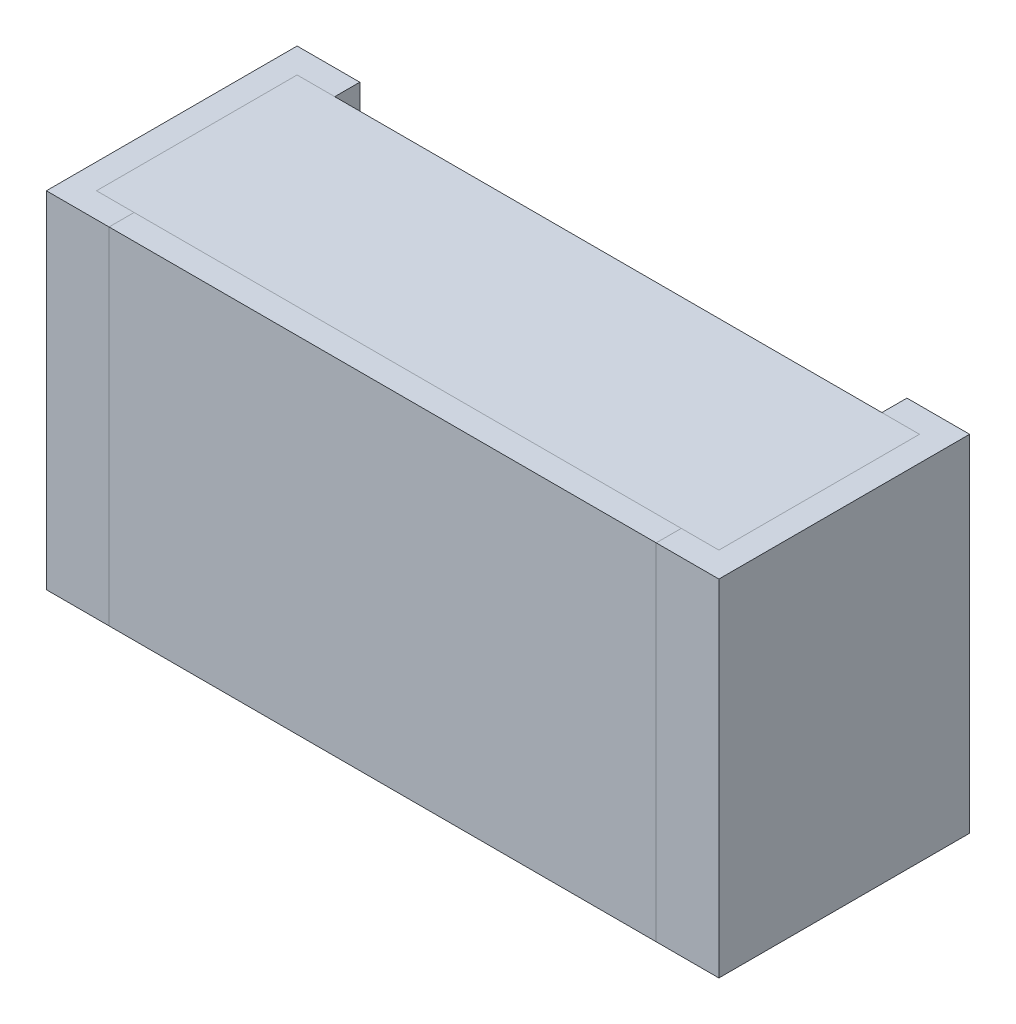
ISO-10303-21;
HEADER;
FILE_DESCRIPTION(('STEP AP214'),'2;1');
FILE_NAME('part.step','',(''),(''),'','','');
FILE_SCHEMA(('AUTOMOTIVE_DESIGN { 1 0 10303 214 1 1 1 1 }'));
ENDSEC;
DATA;
#1=APPLICATION_CONTEXT('core data for automotive mechanical design processes');
#2=APPLICATION_PROTOCOL_DEFINITION('international standard','automotive_design',2000,#1);
#3=PRODUCT_CONTEXT('',#1,'mechanical');
#4=PRODUCT('Part','Part','',(#3));
#5=PRODUCT_RELATED_PRODUCT_CATEGORY('part','',(#4));
#6=PRODUCT_DEFINITION_FORMATION('','',#4);
#7=PRODUCT_DEFINITION_CONTEXT('part definition',#1,'design');
#8=PRODUCT_DEFINITION('design','',#6,#7);
#9=PRODUCT_DEFINITION_SHAPE('','',#8);
#10=(LENGTH_UNIT() NAMED_UNIT(*) SI_UNIT(.MILLI.,.METRE.));
#11=(NAMED_UNIT(*) PLANE_ANGLE_UNIT() SI_UNIT($,.RADIAN.));
#12=(NAMED_UNIT(*) SI_UNIT($,.STERADIAN.) SOLID_ANGLE_UNIT());
#13=UNCERTAINTY_MEASURE_WITH_UNIT(LENGTH_MEASURE(1.E-05),#10,'distance_accuracy_value','');
#14=(GEOMETRIC_REPRESENTATION_CONTEXT(3) GLOBAL_UNCERTAINTY_ASSIGNED_CONTEXT((#13)) GLOBAL_UNIT_ASSIGNED_CONTEXT((#10,
#11,#12)) REPRESENTATION_CONTEXT('',''));
#15=CARTESIAN_POINT('',(0.,0.,0.));
#16=DIRECTION('',(0.,0.,1.));
#17=DIRECTION('',(1.,0.,0.));
#18=AXIS2_PLACEMENT_3D('',#15,#16,#17);
#19=CARTESIAN_POINT('',(-0.50436,-0.28,0.04064));
#20=DIRECTION('',(1.,0.,0.));
#21=DIRECTION('',(0.,0.,1.));
#22=AXIS2_PLACEMENT_3D('',#19,#20,#21);
#23=PLANE('',#22);
#24=DIRECTION('',(0.,1.,0.));
#25=VECTOR('',#24,1.);
#26=CARTESIAN_POINT('',(-0.50436,-0.28,0.36576));
#27=LINE('',#26,#25);
#28=CARTESIAN_POINT('',(-0.50436,-0.28,0.36576));
#29=VERTEX_POINT('',#28);
#30=CARTESIAN_POINT('',(-0.50436,0.28,0.36576));
#31=VERTEX_POINT('',#30);
#32=EDGE_CURVE('P0_E11',#29,#31,#27,.T.);
#33=ORIENTED_EDGE('',*,*,#32,.T.);
#34=DIRECTION('',(0.,0.,1.));
#35=VECTOR('',#34,1.);
#36=CARTESIAN_POINT('',(-0.50436,0.28,0.04064));
#37=LINE('',#36,#35);
#38=CARTESIAN_POINT('',(-0.50436,0.28,0.04064));
#39=VERTEX_POINT('',#38);
#40=EDGE_CURVE('P0_E24',#39,#31,#37,.T.);
#41=ORIENTED_EDGE('',*,*,#40,.F.);
#42=DIRECTION('',(0.,1.,0.));
#43=VECTOR('',#42,1.);
#44=CARTESIAN_POINT('',(-0.50436,-0.28,0.04064));
#45=LINE('',#44,#43);
#46=CARTESIAN_POINT('',(-0.50436,-0.28,0.04064));
#47=VERTEX_POINT('',#46);
#48=EDGE_CURVE('P0_E86',#47,#39,#45,.T.);
#49=ORIENTED_EDGE('',*,*,#48,.F.);
#50=DIRECTION('',(0.,0.,1.));
#51=VECTOR('',#50,1.);
#52=CARTESIAN_POINT('',(-0.50436,-0.28,0.04064));
#53=LINE('',#52,#51);
#54=EDGE_CURVE('P0_E36',#47,#29,#53,.T.);
#55=ORIENTED_EDGE('',*,*,#54,.T.);
#56=EDGE_LOOP('',(#33,#41,#49,#55));
#57=FACE_BOUND('',#56,.T.);
#58=ADVANCED_FACE('P0_F17',(#57),#23,.F.);
#59=CARTESIAN_POINT('',(0.50436,-0.28,0.04064));
#60=DIRECTION('',(1.,0.,0.));
#61=DIRECTION('',(0.,0.,1.));
#62=AXIS2_PLACEMENT_3D('',#59,#60,#61);
#63=PLANE('',#62);
#64=DIRECTION('',(0.,0.,1.));
#65=VECTOR('',#64,1.);
#66=CARTESIAN_POINT('',(0.50436,-0.28,0.04064));
#67=LINE('',#66,#65);
#68=CARTESIAN_POINT('',(0.50436,-0.28,0.04064));
#69=VERTEX_POINT('',#68);
#70=CARTESIAN_POINT('',(0.50436,-0.28,0.36576));
#71=VERTEX_POINT('',#70);
#72=EDGE_CURVE('P0_E83',#69,#71,#67,.T.);
#73=ORIENTED_EDGE('',*,*,#72,.F.);
#74=DIRECTION('',(0.,1.,0.));
#75=VECTOR('',#74,1.);
#76=CARTESIAN_POINT('',(0.50436,-0.28,0.04064));
#77=LINE('',#76,#75);
#78=CARTESIAN_POINT('',(0.50436,0.28,0.04064));
#79=VERTEX_POINT('',#78);
#80=EDGE_CURVE('P0_E63',#69,#79,#77,.T.);
#81=ORIENTED_EDGE('',*,*,#80,.T.);
#82=DIRECTION('',(0.,0.,1.));
#83=VECTOR('',#82,1.);
#84=CARTESIAN_POINT('',(0.50436,0.28,0.04064));
#85=LINE('',#84,#83);
#86=CARTESIAN_POINT('',(0.50436,0.28,0.36576));
#87=VERTEX_POINT('',#86);
#88=EDGE_CURVE('P0_E57',#79,#87,#85,.T.);
#89=ORIENTED_EDGE('',*,*,#88,.T.);
#90=DIRECTION('',(0.,1.,0.));
#91=VECTOR('',#90,1.);
#92=CARTESIAN_POINT('',(0.50436,-0.28,0.36576));
#93=LINE('',#92,#91);
#94=EDGE_CURVE('P0_E60',#71,#87,#93,.T.);
#95=ORIENTED_EDGE('',*,*,#94,.F.);
#96=EDGE_LOOP('',(#73,#81,#89,#95));
#97=FACE_BOUND('',#96,.T.);
#98=ADVANCED_FACE('P0_F59',(#97),#63,.T.);
#99=CARTESIAN_POINT('',(-0.50436,-0.28,0.04064));
#100=DIRECTION('',(0.,1.,0.));
#101=DIRECTION('',(0.,0.,1.));
#102=AXIS2_PLACEMENT_3D('',#99,#100,#101);
#103=PLANE('',#102);
#104=ORIENTED_EDGE('',*,*,#72,.T.);
#105=DIRECTION('',(1.,0.,0.));
#106=VECTOR('',#105,1.);
#107=CARTESIAN_POINT('',(-0.50436,-0.28,0.36576));
#108=LINE('',#107,#106);
#109=EDGE_CURVE('P0_E71',#29,#71,#108,.T.);
#110=ORIENTED_EDGE('',*,*,#109,.F.);
#111=ORIENTED_EDGE('',*,*,#54,.F.);
#112=DIRECTION('',(1.,0.,0.));
#113=VECTOR('',#112,1.);
#114=CARTESIAN_POINT('',(-0.50436,-0.28,0.04064));
#115=LINE('',#114,#113);
#116=EDGE_CURVE('P0_E76',#47,#69,#115,.T.);
#117=ORIENTED_EDGE('',*,*,#116,.T.);
#118=EDGE_LOOP('',(#104,#110,#111,#117));
#119=FACE_BOUND('',#118,.T.);
#120=ADVANCED_FACE('P0_F91',(#119),#103,.F.);
#121=CARTESIAN_POINT('',(-0.50436,0.28,0.04064));
#122=DIRECTION('',(0.,1.,0.));
#123=DIRECTION('',(0.,0.,1.));
#124=AXIS2_PLACEMENT_3D('',#121,#122,#123);
#125=PLANE('',#124);
#126=DIRECTION('',(1.,0.,0.));
#127=VECTOR('',#126,1.);
#128=CARTESIAN_POINT('',(-0.50436,0.28,0.04064));
#129=LINE('',#128,#127);
#130=EDGE_CURVE('P0_E74',#39,#79,#129,.T.);
#131=ORIENTED_EDGE('',*,*,#130,.F.);
#132=ORIENTED_EDGE('',*,*,#40,.T.);
#133=DIRECTION('',(1.,0.,0.));
#134=VECTOR('',#133,1.);
#135=CARTESIAN_POINT('',(-0.50436,0.28,0.36576));
#136=LINE('',#135,#134);
#137=EDGE_CURVE('P0_E69',#31,#87,#136,.T.);
#138=ORIENTED_EDGE('',*,*,#137,.T.);
#139=ORIENTED_EDGE('',*,*,#88,.F.);
#140=EDGE_LOOP('',(#131,#132,#138,#139));
#141=FACE_BOUND('',#140,.T.);
#142=ADVANCED_FACE('P0_F73',(#141),#125,.T.);
#143=CARTESIAN_POINT('',(-0.50436,-0.28,0.04064));
#144=DIRECTION('',(0.,0.,1.));
#145=DIRECTION('',(1.,0.,0.));
#146=AXIS2_PLACEMENT_3D('',#143,#144,#145);
#147=PLANE('',#146);
#148=ORIENTED_EDGE('',*,*,#130,.T.);
#149=ORIENTED_EDGE('',*,*,#80,.F.);
#150=ORIENTED_EDGE('',*,*,#116,.F.);
#151=ORIENTED_EDGE('',*,*,#48,.T.);
#152=EDGE_LOOP('',(#148,#149,#150,#151));
#153=FACE_BOUND('',#152,.T.);
#154=ADVANCED_FACE('P0_F89',(#153),#147,.F.);
#155=CARTESIAN_POINT('',(-0.50436,-0.28,0.36576));
#156=DIRECTION('',(0.,0.,1.));
#157=DIRECTION('',(1.,0.,0.));
#158=AXIS2_PLACEMENT_3D('',#155,#156,#157);
#159=PLANE('',#158);
#160=ORIENTED_EDGE('',*,*,#32,.F.);
#161=ORIENTED_EDGE('',*,*,#109,.T.);
#162=ORIENTED_EDGE('',*,*,#94,.T.);
#163=ORIENTED_EDGE('',*,*,#137,.F.);
#164=EDGE_LOOP('',(#160,#161,#162,#163));
#165=FACE_BOUND('',#164,.T.);
#166=ADVANCED_FACE('P0_F68',(#165),#159,.T.);
#167=CLOSED_SHELL('',(#58,#98,#120,#142,#154,#166));
#168=MANIFOLD_SOLID_BREP('P0_B1',#167);
#169=CARTESIAN_POINT('',(-0.545,-0.28,0.));
#170=DIRECTION('',(1.,0.,0.));
#171=DIRECTION('',(0.,0.,1.));
#172=AXIS2_PLACEMENT_3D('',#169,#170,#171);
#173=PLANE('',#172);
#174=DIRECTION('',(0.,1.,0.));
#175=VECTOR('',#174,1.);
#176=CARTESIAN_POINT('',(-0.545,-0.28,0.4064));
#177=LINE('',#176,#175);
#178=CARTESIAN_POINT('',(-0.545,-0.28,0.4064));
#179=VERTEX_POINT('',#178);
#180=CARTESIAN_POINT('',(-0.545,0.28,0.4064));
#181=VERTEX_POINT('',#180);
#182=EDGE_CURVE('P1_E11',#179,#181,#177,.T.);
#183=ORIENTED_EDGE('',*,*,#182,.T.);
#184=DIRECTION('',(0.,0.,1.));
#185=VECTOR('',#184,1.);
#186=CARTESIAN_POINT('',(-0.545,0.28,0.));
#187=LINE('',#186,#185);
#188=CARTESIAN_POINT('',(-0.545,0.28,0.));
#189=VERTEX_POINT('',#188);
#190=EDGE_CURVE('P1_E24',#189,#181,#187,.T.);
#191=ORIENTED_EDGE('',*,*,#190,.F.);
#192=DIRECTION('',(0.,1.,0.));
#193=VECTOR('',#192,1.);
#194=CARTESIAN_POINT('',(-0.545,-0.28,0.));
#195=LINE('',#194,#193);
#196=CARTESIAN_POINT('',(-0.545,-0.28,0.));
#197=VERTEX_POINT('',#196);
#198=EDGE_CURVE('P1_E139',#197,#189,#195,.T.);
#199=ORIENTED_EDGE('',*,*,#198,.F.);
#200=DIRECTION('',(0.,0.,1.));
#201=VECTOR('',#200,1.);
#202=CARTESIAN_POINT('',(-0.545,-0.28,0.));
#203=LINE('',#202,#201);
#204=EDGE_CURVE('P1_E36',#197,#179,#203,.T.);
#205=ORIENTED_EDGE('',*,*,#204,.T.);
#206=EDGE_LOOP('',(#183,#191,#199,#205));
#207=FACE_BOUND('',#206,.T.);
#208=ADVANCED_FACE('P1_F17',(#207),#173,.F.);
#209=CARTESIAN_POINT('',(-0.545,-0.28,0.));
#210=DIRECTION('',(0.,1.,0.));
#211=DIRECTION('',(0.,0.,1.));
#212=AXIS2_PLACEMENT_3D('',#209,#210,#211);
#213=PLANE('',#212);
#214=DIRECTION('',(1.,0.,0.));
#215=VECTOR('',#214,1.);
#216=CARTESIAN_POINT('',(-0.50436,-0.28,0.04064));
#217=LINE('',#216,#215);
#218=CARTESIAN_POINT('',(-0.50436,-0.28,0.04064));
#219=VERTEX_POINT('',#218);
#220=CARTESIAN_POINT('',(-0.4434,-0.28,0.04064));
#221=VERTEX_POINT('',#220);
#222=EDGE_CURVE('P1_E136',#219,#221,#217,.T.);
#223=ORIENTED_EDGE('',*,*,#222,.F.);
#224=DIRECTION('',(0.,0.,1.));
#225=VECTOR('',#224,1.);
#226=CARTESIAN_POINT('',(-0.50436,-0.28,0.04064));
#227=LINE('',#226,#225);
#228=CARTESIAN_POINT('',(-0.50436,-0.28,0.36576));
#229=VERTEX_POINT('',#228);
#230=EDGE_CURVE('P1_E99',#219,#229,#227,.T.);
#231=ORIENTED_EDGE('',*,*,#230,.T.);
#232=DIRECTION('',(1.,0.,0.));
#233=VECTOR('',#232,1.);
#234=CARTESIAN_POINT('',(-0.50436,-0.28,0.36576));
#235=LINE('',#234,#233);
#236=CARTESIAN_POINT('',(-0.4434,-0.28,0.36576));
#237=VERTEX_POINT('',#236);
#238=EDGE_CURVE('P1_E132',#229,#237,#235,.T.);
#239=ORIENTED_EDGE('',*,*,#238,.T.);
#240=DIRECTION('',(0.,0.,1.));
#241=VECTOR('',#240,1.);
#242=CARTESIAN_POINT('',(-0.4434,-0.28,0.));
#243=LINE('',#242,#241);
#244=CARTESIAN_POINT('',(-0.4434,-0.28,0.4064));
#245=VERTEX_POINT('',#244);
#246=EDGE_CURVE('P1_E129',#237,#245,#243,.T.);
#247=ORIENTED_EDGE('',*,*,#246,.T.);
#248=DIRECTION('',(1.,0.,0.));
#249=VECTOR('',#248,1.);
#250=CARTESIAN_POINT('',(-0.545,-0.28,0.4064));
#251=LINE('',#250,#249);
#252=EDGE_CURVE('P1_E127',#179,#245,#251,.T.);
#253=ORIENTED_EDGE('',*,*,#252,.F.);
#254=ORIENTED_EDGE('',*,*,#204,.F.);
#255=DIRECTION('',(1.,0.,0.));
#256=VECTOR('',#255,1.);
#257=CARTESIAN_POINT('',(-0.545,-0.28,0.));
#258=LINE('',#257,#256);
#259=CARTESIAN_POINT('',(-0.4434,-0.28,0.));
#260=VERTEX_POINT('',#259);
#261=EDGE_CURVE('P1_E124',#197,#260,#258,.T.);
#262=ORIENTED_EDGE('',*,*,#261,.T.);
#263=DIRECTION('',(0.,0.,1.));
#264=VECTOR('',#263,1.);
#265=CARTESIAN_POINT('',(-0.4434,-0.28,0.));
#266=LINE('',#265,#264);
#267=EDGE_CURVE('P1_E122',#260,#221,#266,.T.);
#268=ORIENTED_EDGE('',*,*,#267,.T.);
#269=EDGE_LOOP('',(#223,#231,#239,#247,#253,#254,#262,#268));
#270=FACE_BOUND('',#269,.T.);
#271=ADVANCED_FACE('P1_F161',(#270),#213,.F.);
#272=CARTESIAN_POINT('',(-0.545,-0.28,0.4064));
#273=DIRECTION('',(0.,0.,1.));
#274=DIRECTION('',(1.,0.,0.));
#275=AXIS2_PLACEMENT_3D('',#272,#273,#274);
#276=PLANE('',#275);
#277=ORIENTED_EDGE('',*,*,#182,.F.);
#278=ORIENTED_EDGE('',*,*,#252,.T.);
#279=DIRECTION('',(0.,1.,0.));
#280=VECTOR('',#279,1.);
#281=CARTESIAN_POINT('',(-0.4434,-0.28,0.4064));
#282=LINE('',#281,#280);
#283=CARTESIAN_POINT('',(-0.4434,0.28,0.4064));
#284=VERTEX_POINT('',#283);
#285=EDGE_CURVE('P1_E120',#245,#284,#282,.T.);
#286=ORIENTED_EDGE('',*,*,#285,.T.);
#287=DIRECTION('',(1.,0.,0.));
#288=VECTOR('',#287,1.);
#289=CARTESIAN_POINT('',(-0.545,0.28,0.4064));
#290=LINE('',#289,#288);
#291=EDGE_CURVE('P1_E118',#181,#284,#290,.T.);
#292=ORIENTED_EDGE('',*,*,#291,.F.);
#293=EDGE_LOOP('',(#277,#278,#286,#292));
#294=FACE_BOUND('',#293,.T.);
#295=ADVANCED_FACE('P1_F163',(#294),#276,.T.);
#296=CARTESIAN_POINT('',(-0.545,0.28,0.));
#297=DIRECTION('',(0.,1.,0.));
#298=DIRECTION('',(0.,0.,1.));
#299=AXIS2_PLACEMENT_3D('',#296,#297,#298);
#300=PLANE('',#299);
#301=DIRECTION('',(0.,0.,1.));
#302=VECTOR('',#301,1.);
#303=CARTESIAN_POINT('',(-0.4434,0.28,0.));
#304=LINE('',#303,#302);
#305=CARTESIAN_POINT('',(-0.4434,0.28,0.));
#306=VERTEX_POINT('',#305);
#307=CARTESIAN_POINT('',(-0.4434,0.28,0.04064));
#308=VERTEX_POINT('',#307);
#309=EDGE_CURVE('P1_E116',#306,#308,#304,.T.);
#310=ORIENTED_EDGE('',*,*,#309,.F.);
#311=DIRECTION('',(1.,0.,0.));
#312=VECTOR('',#311,1.);
#313=CARTESIAN_POINT('',(-0.545,0.28,0.));
#314=LINE('',#313,#312);
#315=EDGE_CURVE('P1_E113',#189,#306,#314,.T.);
#316=ORIENTED_EDGE('',*,*,#315,.F.);
#317=ORIENTED_EDGE('',*,*,#190,.T.);
#318=ORIENTED_EDGE('',*,*,#291,.T.);
#319=DIRECTION('',(0.,0.,1.));
#320=VECTOR('',#319,1.);
#321=CARTESIAN_POINT('',(-0.4434,0.28,0.));
#322=LINE('',#321,#320);
#323=CARTESIAN_POINT('',(-0.4434,0.28,0.36576));
#324=VERTEX_POINT('',#323);
#325=EDGE_CURVE('P1_E107',#324,#284,#322,.T.);
#326=ORIENTED_EDGE('',*,*,#325,.F.);
#327=DIRECTION('',(1.,0.,0.));
#328=VECTOR('',#327,1.);
#329=CARTESIAN_POINT('',(-0.50436,0.28,0.36576));
#330=LINE('',#329,#328);
#331=CARTESIAN_POINT('',(-0.50436,0.28,0.36576));
#332=VERTEX_POINT('',#331);
#333=EDGE_CURVE('P1_E105',#332,#324,#330,.T.);
#334=ORIENTED_EDGE('',*,*,#333,.F.);
#335=DIRECTION('',(0.,0.,1.));
#336=VECTOR('',#335,1.);
#337=CARTESIAN_POINT('',(-0.50436,0.28,0.04064));
#338=LINE('',#337,#336);
#339=CARTESIAN_POINT('',(-0.50436,0.28,0.04064));
#340=VERTEX_POINT('',#339);
#341=EDGE_CURVE('P1_E90',#340,#332,#338,.T.);
#342=ORIENTED_EDGE('',*,*,#341,.F.);
#343=DIRECTION('',(1.,0.,0.));
#344=VECTOR('',#343,1.);
#345=CARTESIAN_POINT('',(-0.50436,0.28,0.04064));
#346=LINE('',#345,#344);
#347=EDGE_CURVE('P1_E82',#340,#308,#346,.T.);
#348=ORIENTED_EDGE('',*,*,#347,.T.);
#349=EDGE_LOOP('',(#310,#316,#317,#318,#326,#334,#342,#348));
#350=FACE_BOUND('',#349,.T.);
#351=ADVANCED_FACE('P1_F103',(#350),#300,.T.);
#352=CARTESIAN_POINT('',(-0.545,-0.28,0.));
#353=DIRECTION('',(0.,0.,1.));
#354=DIRECTION('',(1.,0.,0.));
#355=AXIS2_PLACEMENT_3D('',#352,#353,#354);
#356=PLANE('',#355);
#357=ORIENTED_EDGE('',*,*,#315,.T.);
#358=DIRECTION('',(0.,1.,0.));
#359=VECTOR('',#358,1.);
#360=CARTESIAN_POINT('',(-0.4434,-0.28,0.));
#361=LINE('',#360,#359);
#362=EDGE_CURVE('P1_E91',#260,#306,#361,.T.);
#363=ORIENTED_EDGE('',*,*,#362,.F.);
#364=ORIENTED_EDGE('',*,*,#261,.F.);
#365=ORIENTED_EDGE('',*,*,#198,.T.);
#366=EDGE_LOOP('',(#357,#363,#364,#365));
#367=FACE_BOUND('',#366,.T.);
#368=ADVANCED_FACE('P1_F142',(#367),#356,.F.);
#369=CARTESIAN_POINT('',(-0.4434,-0.28,0.));
#370=DIRECTION('',(1.,0.,0.));
#371=DIRECTION('',(0.,0.,1.));
#372=AXIS2_PLACEMENT_3D('',#369,#370,#371);
#373=PLANE('',#372);
#374=ORIENTED_EDGE('',*,*,#267,.F.);
#375=ORIENTED_EDGE('',*,*,#362,.T.);
#376=ORIENTED_EDGE('',*,*,#309,.T.);
#377=DIRECTION('',(0.,-1.,0.));
#378=VECTOR('',#377,1.);
#379=CARTESIAN_POINT('',(-0.4434,-0.28,0.04064));
#380=LINE('',#379,#378);
#381=EDGE_CURVE('P1_E88',#308,#221,#380,.T.);
#382=ORIENTED_EDGE('',*,*,#381,.T.);
#383=EDGE_LOOP('',(#374,#375,#376,#382));
#384=FACE_BOUND('',#383,.T.);
#385=ADVANCED_FACE('P1_F147',(#384),#373,.T.);
#386=CARTESIAN_POINT('',(-0.50436,-0.28,0.04064));
#387=DIRECTION('',(0.,0.,1.));
#388=DIRECTION('',(1.,0.,0.));
#389=AXIS2_PLACEMENT_3D('',#386,#387,#388);
#390=PLANE('',#389);
#391=ORIENTED_EDGE('',*,*,#347,.F.);
#392=DIRECTION('',(0.,1.,0.));
#393=VECTOR('',#392,1.);
#394=CARTESIAN_POINT('',(-0.50436,-0.28,0.04064));
#395=LINE('',#394,#393);
#396=EDGE_CURVE('P1_E86',#219,#340,#395,.T.);
#397=ORIENTED_EDGE('',*,*,#396,.F.);
#398=ORIENTED_EDGE('',*,*,#222,.T.);
#399=ORIENTED_EDGE('',*,*,#381,.F.);
#400=EDGE_LOOP('',(#391,#397,#398,#399));
#401=FACE_BOUND('',#400,.T.);
#402=ADVANCED_FACE('P1_F84',(#401),#390,.T.);
#403=CARTESIAN_POINT('',(-0.50436,-0.28,0.04064));
#404=DIRECTION('',(1.,0.,0.));
#405=DIRECTION('',(0.,0.,1.));
#406=AXIS2_PLACEMENT_3D('',#403,#404,#405);
#407=PLANE('',#406);
#408=ORIENTED_EDGE('',*,*,#230,.F.);
#409=ORIENTED_EDGE('',*,*,#396,.T.);
#410=ORIENTED_EDGE('',*,*,#341,.T.);
#411=DIRECTION('',(0.,1.,0.));
#412=VECTOR('',#411,1.);
#413=CARTESIAN_POINT('',(-0.50436,-0.28,0.36576));
#414=LINE('',#413,#412);
#415=EDGE_CURVE('P1_E101',#229,#332,#414,.T.);
#416=ORIENTED_EDGE('',*,*,#415,.F.);
#417=EDGE_LOOP('',(#408,#409,#410,#416));
#418=FACE_BOUND('',#417,.T.);
#419=ADVANCED_FACE('P1_F95',(#418),#407,.T.);
#420=CARTESIAN_POINT('',(-0.50436,-0.28,0.36576));
#421=DIRECTION('',(0.,0.,1.));
#422=DIRECTION('',(1.,0.,0.));
#423=AXIS2_PLACEMENT_3D('',#420,#421,#422);
#424=PLANE('',#423);
#425=DIRECTION('',(0.,-1.,0.));
#426=VECTOR('',#425,1.);
#427=CARTESIAN_POINT('',(-0.4434,-0.28,0.36576));
#428=LINE('',#427,#426);
#429=EDGE_CURVE('P1_E151',#324,#237,#428,.T.);
#430=ORIENTED_EDGE('',*,*,#429,.T.);
#431=ORIENTED_EDGE('',*,*,#238,.F.);
#432=ORIENTED_EDGE('',*,*,#415,.T.);
#433=ORIENTED_EDGE('',*,*,#333,.T.);
#434=EDGE_LOOP('',(#430,#431,#432,#433));
#435=FACE_BOUND('',#434,.T.);
#436=ADVANCED_FACE('P1_F155',(#435),#424,.F.);
#437=CARTESIAN_POINT('',(-0.4434,-0.28,0.));
#438=DIRECTION('',(1.,0.,0.));
#439=DIRECTION('',(0.,0.,1.));
#440=AXIS2_PLACEMENT_3D('',#437,#438,#439);
#441=PLANE('',#440);
#442=ORIENTED_EDGE('',*,*,#246,.F.);
#443=ORIENTED_EDGE('',*,*,#429,.F.);
#444=ORIENTED_EDGE('',*,*,#325,.T.);
#445=ORIENTED_EDGE('',*,*,#285,.F.);
#446=EDGE_LOOP('',(#442,#443,#444,#445));
#447=FACE_BOUND('',#446,.T.);
#448=ADVANCED_FACE('P1_F157',(#447),#441,.T.);
#449=CLOSED_SHELL('',(#208,#271,#295,#351,#368,#385,#402,#419,#436,#448));
#450=MANIFOLD_SOLID_BREP('P1_B1',#449);
#451=CARTESIAN_POINT('',(0.545,0.28,0.));
#452=DIRECTION('',(-1.,0.,0.));
#453=DIRECTION('',(0.,0.,1.));
#454=AXIS2_PLACEMENT_3D('',#451,#452,#453);
#455=PLANE('',#454);
#456=DIRECTION('',(0.,-1.,0.));
#457=VECTOR('',#456,1.);
#458=CARTESIAN_POINT('',(0.545,0.28,0.4064));
#459=LINE('',#458,#457);
#460=CARTESIAN_POINT('',(0.545,0.28,0.4064));
#461=VERTEX_POINT('',#460);
#462=CARTESIAN_POINT('',(0.545,-0.28,0.4064));
#463=VERTEX_POINT('',#462);
#464=EDGE_CURVE('P2_E11',#461,#463,#459,.T.);
#465=ORIENTED_EDGE('',*,*,#464,.T.);
#466=DIRECTION('',(0.,0.,1.));
#467=VECTOR('',#466,1.);
#468=CARTESIAN_POINT('',(0.545,-0.28,0.));
#469=LINE('',#468,#467);
#470=CARTESIAN_POINT('',(0.545,-0.28,0.));
#471=VERTEX_POINT('',#470);
#472=EDGE_CURVE('P2_E24',#471,#463,#469,.T.);
#473=ORIENTED_EDGE('',*,*,#472,.F.);
#474=DIRECTION('',(0.,-1.,0.));
#475=VECTOR('',#474,1.);
#476=CARTESIAN_POINT('',(0.545,0.28,0.));
#477=LINE('',#476,#475);
#478=CARTESIAN_POINT('',(0.545,0.28,0.));
#479=VERTEX_POINT('',#478);
#480=EDGE_CURVE('P2_E144',#479,#471,#477,.T.);
#481=ORIENTED_EDGE('',*,*,#480,.F.);
#482=DIRECTION('',(0.,0.,1.));
#483=VECTOR('',#482,1.);
#484=CARTESIAN_POINT('',(0.545,0.28,0.));
#485=LINE('',#484,#483);
#486=EDGE_CURVE('P2_E36',#479,#461,#485,.T.);
#487=ORIENTED_EDGE('',*,*,#486,.T.);
#488=EDGE_LOOP('',(#465,#473,#481,#487));
#489=FACE_BOUND('',#488,.T.);
#490=ADVANCED_FACE('P2_F17',(#489),#455,.F.);
#491=CARTESIAN_POINT('',(0.545,0.28,0.));
#492=DIRECTION('',(0.,-1.,0.));
#493=DIRECTION('',(0.,0.,1.));
#494=AXIS2_PLACEMENT_3D('',#491,#492,#493);
#495=PLANE('',#494);
#496=DIRECTION('',(-1.,0.,0.));
#497=VECTOR('',#496,1.);
#498=CARTESIAN_POINT('',(0.50436,0.28,0.04064));
#499=LINE('',#498,#497);
#500=CARTESIAN_POINT('',(0.50436,0.28,0.04064));
#501=VERTEX_POINT('',#500);
#502=CARTESIAN_POINT('',(0.4434,0.28,0.04064));
#503=VERTEX_POINT('',#502);
#504=EDGE_CURVE('P2_E141',#501,#503,#499,.T.);
#505=ORIENTED_EDGE('',*,*,#504,.F.);
#506=DIRECTION('',(0.,0.,1.));
#507=VECTOR('',#506,1.);
#508=CARTESIAN_POINT('',(0.50436,0.28,0.04064));
#509=LINE('',#508,#507);
#510=CARTESIAN_POINT('',(0.50436,0.28,0.36576));
#511=VERTEX_POINT('',#510);
#512=EDGE_CURVE('P2_E103',#501,#511,#509,.T.);
#513=ORIENTED_EDGE('',*,*,#512,.T.);
#514=DIRECTION('',(-1.,0.,0.));
#515=VECTOR('',#514,1.);
#516=CARTESIAN_POINT('',(0.50436,0.28,0.36576));
#517=LINE('',#516,#515);
#518=CARTESIAN_POINT('',(0.4434,0.28,0.36576));
#519=VERTEX_POINT('',#518);
#520=EDGE_CURVE('P2_E137',#511,#519,#517,.T.);
#521=ORIENTED_EDGE('',*,*,#520,.T.);
#522=DIRECTION('',(0.,0.,1.));
#523=VECTOR('',#522,1.);
#524=CARTESIAN_POINT('',(0.4434,0.28,0.));
#525=LINE('',#524,#523);
#526=CARTESIAN_POINT('',(0.4434,0.28,0.4064));
#527=VERTEX_POINT('',#526);
#528=EDGE_CURVE('P2_E134',#519,#527,#525,.T.);
#529=ORIENTED_EDGE('',*,*,#528,.T.);
#530=DIRECTION('',(-1.,0.,0.));
#531=VECTOR('',#530,1.);
#532=CARTESIAN_POINT('',(0.545,0.28,0.4064));
#533=LINE('',#532,#531);
#534=EDGE_CURVE('P2_E132',#461,#527,#533,.T.);
#535=ORIENTED_EDGE('',*,*,#534,.F.);
#536=ORIENTED_EDGE('',*,*,#486,.F.);
#537=DIRECTION('',(-1.,0.,0.));
#538=VECTOR('',#537,1.);
#539=CARTESIAN_POINT('',(0.545,0.28,0.));
#540=LINE('',#539,#538);
#541=CARTESIAN_POINT('',(0.4434,0.28,0.));
#542=VERTEX_POINT('',#541);
#543=EDGE_CURVE('P2_E129',#479,#542,#540,.T.);
#544=ORIENTED_EDGE('',*,*,#543,.T.);
#545=DIRECTION('',(0.,0.,1.));
#546=VECTOR('',#545,1.);
#547=CARTESIAN_POINT('',(0.4434,0.28,0.));
#548=LINE('',#547,#546);
#549=EDGE_CURVE('P2_E127',#542,#503,#548,.T.);
#550=ORIENTED_EDGE('',*,*,#549,.T.);
#551=EDGE_LOOP('',(#505,#513,#521,#529,#535,#536,#544,#550));
#552=FACE_BOUND('',#551,.T.);
#553=ADVANCED_FACE('P2_F153',(#552),#495,.F.);
#554=CARTESIAN_POINT('',(0.545,0.28,0.4064));
#555=DIRECTION('',(0.,0.,1.));
#556=DIRECTION('',(-1.,0.,0.));
#557=AXIS2_PLACEMENT_3D('',#554,#555,#556);
#558=PLANE('',#557);
#559=ORIENTED_EDGE('',*,*,#464,.F.);
#560=ORIENTED_EDGE('',*,*,#534,.T.);
#561=DIRECTION('',(0.,-1.,0.));
#562=VECTOR('',#561,1.);
#563=CARTESIAN_POINT('',(0.4434,0.28,0.4064));
#564=LINE('',#563,#562);
#565=CARTESIAN_POINT('',(0.4434,-0.28,0.4064));
#566=VERTEX_POINT('',#565);
#567=EDGE_CURVE('P2_E125',#527,#566,#564,.T.);
#568=ORIENTED_EDGE('',*,*,#567,.T.);
#569=DIRECTION('',(-1.,0.,0.));
#570=VECTOR('',#569,1.);
#571=CARTESIAN_POINT('',(0.545,-0.28,0.4064));
#572=LINE('',#571,#570);
#573=EDGE_CURVE('P2_E123',#463,#566,#572,.T.);
#574=ORIENTED_EDGE('',*,*,#573,.F.);
#575=EDGE_LOOP('',(#559,#560,#568,#574));
#576=FACE_BOUND('',#575,.T.);
#577=ADVANCED_FACE('P2_F157',(#576),#558,.T.);
#578=CARTESIAN_POINT('',(0.545,-0.28,0.));
#579=DIRECTION('',(0.,-1.,0.));
#580=DIRECTION('',(0.,0.,1.));
#581=AXIS2_PLACEMENT_3D('',#578,#579,#580);
#582=PLANE('',#581);
#583=DIRECTION('',(0.,0.,1.));
#584=VECTOR('',#583,1.);
#585=CARTESIAN_POINT('',(0.4434,-0.28,0.));
#586=LINE('',#585,#584);
#587=CARTESIAN_POINT('',(0.4434,-0.28,0.));
#588=VERTEX_POINT('',#587);
#589=CARTESIAN_POINT('',(0.4434,-0.28,0.04064));
#590=VERTEX_POINT('',#589);
#591=EDGE_CURVE('P2_E121',#588,#590,#586,.T.);
#592=ORIENTED_EDGE('',*,*,#591,.F.);
#593=DIRECTION('',(-1.,0.,0.));
#594=VECTOR('',#593,1.);
#595=CARTESIAN_POINT('',(0.545,-0.28,0.));
#596=LINE('',#595,#594);
#597=EDGE_CURVE('P2_E118',#471,#588,#596,.T.);
#598=ORIENTED_EDGE('',*,*,#597,.F.);
#599=ORIENTED_EDGE('',*,*,#472,.T.);
#600=ORIENTED_EDGE('',*,*,#573,.T.);
#601=DIRECTION('',(0.,0.,1.));
#602=VECTOR('',#601,1.);
#603=CARTESIAN_POINT('',(0.4434,-0.28,0.));
#604=LINE('',#603,#602);
#605=CARTESIAN_POINT('',(0.4434,-0.28,0.36576));
#606=VERTEX_POINT('',#605);
#607=EDGE_CURVE('P2_E115',#606,#566,#604,.T.);
#608=ORIENTED_EDGE('',*,*,#607,.F.);
#609=DIRECTION('',(-1.,0.,0.));
#610=VECTOR('',#609,1.);
#611=CARTESIAN_POINT('',(0.50436,-0.28,0.36576));
#612=LINE('',#611,#610);
#613=CARTESIAN_POINT('',(0.50436,-0.28,0.36576));
#614=VERTEX_POINT('',#613);
#615=EDGE_CURVE('P2_E86',#614,#606,#612,.T.);
#616=ORIENTED_EDGE('',*,*,#615,.F.);
#617=DIRECTION('',(0.,0.,1.));
#618=VECTOR('',#617,1.);
#619=CARTESIAN_POINT('',(0.50436,-0.28,0.04064));
#620=LINE('',#619,#618);
#621=CARTESIAN_POINT('',(0.50436,-0.28,0.04064));
#622=VERTEX_POINT('',#621);
#623=EDGE_CURVE('P2_E80',#622,#614,#620,.T.);
#624=ORIENTED_EDGE('',*,*,#623,.F.);
#625=DIRECTION('',(-1.,0.,0.));
#626=VECTOR('',#625,1.);
#627=CARTESIAN_POINT('',(0.50436,-0.28,0.04064));
#628=LINE('',#627,#626);
#629=EDGE_CURVE('P2_E83',#622,#590,#628,.T.);
#630=ORIENTED_EDGE('',*,*,#629,.T.);
#631=EDGE_LOOP('',(#592,#598,#599,#600,#608,#616,#624,#630));
#632=FACE_BOUND('',#631,.T.);
#633=ADVANCED_FACE('P2_F82',(#632),#582,.T.);
#634=CARTESIAN_POINT('',(0.545,0.28,0.));
#635=DIRECTION('',(0.,0.,1.));
#636=DIRECTION('',(-1.,0.,0.));
#637=AXIS2_PLACEMENT_3D('',#634,#635,#636);
#638=PLANE('',#637);
#639=ORIENTED_EDGE('',*,*,#597,.T.);
#640=DIRECTION('',(0.,-1.,0.));
#641=VECTOR('',#640,1.);
#642=CARTESIAN_POINT('',(0.4434,0.28,0.));
#643=LINE('',#642,#641);
#644=EDGE_CURVE('P2_E99',#542,#588,#643,.T.);
#645=ORIENTED_EDGE('',*,*,#644,.F.);
#646=ORIENTED_EDGE('',*,*,#543,.F.);
#647=ORIENTED_EDGE('',*,*,#480,.T.);
#648=EDGE_LOOP('',(#639,#645,#646,#647));
#649=FACE_BOUND('',#648,.T.);
#650=ADVANCED_FACE('P2_F147',(#649),#638,.F.);
#651=CARTESIAN_POINT('',(0.4434,0.28,0.));
#652=DIRECTION('',(-1.,0.,0.));
#653=DIRECTION('',(0.,0.,1.));
#654=AXIS2_PLACEMENT_3D('',#651,#652,#653);
#655=PLANE('',#654);
#656=ORIENTED_EDGE('',*,*,#549,.F.);
#657=ORIENTED_EDGE('',*,*,#644,.T.);
#658=ORIENTED_EDGE('',*,*,#591,.T.);
#659=DIRECTION('',(0.,1.,0.));
#660=VECTOR('',#659,1.);
#661=CARTESIAN_POINT('',(0.4434,0.28,0.04064));
#662=LINE('',#661,#660);
#663=EDGE_CURVE('P2_E98',#590,#503,#662,.T.);
#664=ORIENTED_EDGE('',*,*,#663,.T.);
#665=EDGE_LOOP('',(#656,#657,#658,#664));
#666=FACE_BOUND('',#665,.T.);
#667=ADVANCED_FACE('P2_F151',(#666),#655,.T.);
#668=CARTESIAN_POINT('',(0.50436,0.28,0.04064));
#669=DIRECTION('',(0.,0.,1.));
#670=DIRECTION('',(-1.,0.,0.));
#671=AXIS2_PLACEMENT_3D('',#668,#669,#670);
#672=PLANE('',#671);
#673=ORIENTED_EDGE('',*,*,#629,.F.);
#674=DIRECTION('',(0.,-1.,0.));
#675=VECTOR('',#674,1.);
#676=CARTESIAN_POINT('',(0.50436,0.28,0.04064));
#677=LINE('',#676,#675);
#678=EDGE_CURVE('P2_E96',#501,#622,#677,.T.);
#679=ORIENTED_EDGE('',*,*,#678,.F.);
#680=ORIENTED_EDGE('',*,*,#504,.T.);
#681=ORIENTED_EDGE('',*,*,#663,.F.);
#682=EDGE_LOOP('',(#673,#679,#680,#681));
#683=FACE_BOUND('',#682,.T.);
#684=ADVANCED_FACE('P2_F94',(#683),#672,.T.);
#685=CARTESIAN_POINT('',(0.50436,0.28,0.04064));
#686=DIRECTION('',(-1.,0.,0.));
#687=DIRECTION('',(0.,0.,1.));
#688=AXIS2_PLACEMENT_3D('',#685,#686,#687);
#689=PLANE('',#688);
#690=ORIENTED_EDGE('',*,*,#512,.F.);
#691=ORIENTED_EDGE('',*,*,#678,.T.);
#692=ORIENTED_EDGE('',*,*,#623,.T.);
#693=DIRECTION('',(0.,-1.,0.));
#694=VECTOR('',#693,1.);
#695=CARTESIAN_POINT('',(0.50436,0.28,0.36576));
#696=LINE('',#695,#694);
#697=EDGE_CURVE('P2_E105',#511,#614,#696,.T.);
#698=ORIENTED_EDGE('',*,*,#697,.F.);
#699=EDGE_LOOP('',(#690,#691,#692,#698));
#700=FACE_BOUND('',#699,.T.);
#701=ADVANCED_FACE('P2_F101',(#700),#689,.T.);
#702=CARTESIAN_POINT('',(0.50436,0.28,0.36576));
#703=DIRECTION('',(0.,0.,1.));
#704=DIRECTION('',(-1.,0.,0.));
#705=AXIS2_PLACEMENT_3D('',#702,#703,#704);
#706=PLANE('',#705);
#707=DIRECTION('',(0.,1.,0.));
#708=VECTOR('',#707,1.);
#709=CARTESIAN_POINT('',(0.4434,0.28,0.36576));
#710=LINE('',#709,#708);
#711=EDGE_CURVE('P2_E108',#606,#519,#710,.T.);
#712=ORIENTED_EDGE('',*,*,#711,.T.);
#713=ORIENTED_EDGE('',*,*,#520,.F.);
#714=ORIENTED_EDGE('',*,*,#697,.T.);
#715=ORIENTED_EDGE('',*,*,#615,.T.);
#716=EDGE_LOOP('',(#712,#713,#714,#715));
#717=FACE_BOUND('',#716,.T.);
#718=ADVANCED_FACE('P2_F163',(#717),#706,.F.);
#719=CARTESIAN_POINT('',(0.4434,0.28,0.));
#720=DIRECTION('',(-1.,0.,0.));
#721=DIRECTION('',(0.,0.,1.));
#722=AXIS2_PLACEMENT_3D('',#719,#720,#721);
#723=PLANE('',#722);
#724=ORIENTED_EDGE('',*,*,#528,.F.);
#725=ORIENTED_EDGE('',*,*,#711,.F.);
#726=ORIENTED_EDGE('',*,*,#607,.T.);
#727=ORIENTED_EDGE('',*,*,#567,.F.);
#728=EDGE_LOOP('',(#724,#725,#726,#727));
#729=FACE_BOUND('',#728,.T.);
#730=ADVANCED_FACE('P2_F160',(#729),#723,.T.);
#731=CLOSED_SHELL('',(#490,#553,#577,#633,#650,#667,#684,#701,#718,#730));
#732=MANIFOLD_SOLID_BREP('P2_B1',#731);
#733=CARTESIAN_POINT('',(-0.4434,-0.28,0.36576));
#734=DIRECTION('',(1.,0.,0.));
#735=DIRECTION('',(0.,0.,1.));
#736=AXIS2_PLACEMENT_3D('',#733,#734,#735);
#737=PLANE('',#736);
#738=DIRECTION('',(0.,1.,0.));
#739=VECTOR('',#738,1.);
#740=CARTESIAN_POINT('',(-0.4434,-0.28,0.4064));
#741=LINE('',#740,#739);
#742=CARTESIAN_POINT('',(-0.4434,-0.28,0.4064));
#743=VERTEX_POINT('',#742);
#744=CARTESIAN_POINT('',(-0.4434,0.28,0.4064));
#745=VERTEX_POINT('',#744);
#746=EDGE_CURVE('P3_E10',#743,#745,#741,.T.);
#747=ORIENTED_EDGE('',*,*,#746,.T.);
#748=DIRECTION('',(0.,0.,1.));
#749=VECTOR('',#748,1.);
#750=CARTESIAN_POINT('',(-0.4434,0.28,0.36576));
#751=LINE('',#750,#749);
#752=CARTESIAN_POINT('',(-0.4434,0.28,0.36576));
#753=VERTEX_POINT('',#752);
#754=EDGE_CURVE('P3_E23',#753,#745,#751,.T.);
#755=ORIENTED_EDGE('',*,*,#754,.F.);
#756=DIRECTION('',(0.,1.,0.));
#757=VECTOR('',#756,1.);
#758=CARTESIAN_POINT('',(-0.4434,-0.28,0.36576));
#759=LINE('',#758,#757);
#760=CARTESIAN_POINT('',(-0.4434,-0.28,0.36576));
#761=VERTEX_POINT('',#760);
#762=EDGE_CURVE('P3_E85',#761,#753,#759,.T.);
#763=ORIENTED_EDGE('',*,*,#762,.F.);
#764=DIRECTION('',(0.,0.,1.));
#765=VECTOR('',#764,1.);
#766=CARTESIAN_POINT('',(-0.4434,-0.28,0.36576));
#767=LINE('',#766,#765);
#768=EDGE_CURVE('P3_E35',#761,#743,#767,.T.);
#769=ORIENTED_EDGE('',*,*,#768,.T.);
#770=EDGE_LOOP('',(#747,#755,#763,#769));
#771=FACE_BOUND('',#770,.T.);
#772=ADVANCED_FACE('P3_F16',(#771),#737,.F.);
#773=CARTESIAN_POINT('',(0.4434,-0.28,0.36576));
#774=DIRECTION('',(1.,0.,0.));
#775=DIRECTION('',(0.,0.,1.));
#776=AXIS2_PLACEMENT_3D('',#773,#774,#775);
#777=PLANE('',#776);
#778=DIRECTION('',(0.,0.,1.));
#779=VECTOR('',#778,1.);
#780=CARTESIAN_POINT('',(0.4434,-0.28,0.36576));
#781=LINE('',#780,#779);
#782=CARTESIAN_POINT('',(0.4434,-0.28,0.36576));
#783=VERTEX_POINT('',#782);
#784=CARTESIAN_POINT('',(0.4434,-0.28,0.4064));
#785=VERTEX_POINT('',#784);
#786=EDGE_CURVE('P3_E82',#783,#785,#781,.T.);
#787=ORIENTED_EDGE('',*,*,#786,.F.);
#788=DIRECTION('',(0.,1.,0.));
#789=VECTOR('',#788,1.);
#790=CARTESIAN_POINT('',(0.4434,-0.28,0.36576));
#791=LINE('',#790,#789);
#792=CARTESIAN_POINT('',(0.4434,0.28,0.36576));
#793=VERTEX_POINT('',#792);
#794=EDGE_CURVE('P3_E62',#783,#793,#791,.T.);
#795=ORIENTED_EDGE('',*,*,#794,.T.);
#796=DIRECTION('',(0.,0.,1.));
#797=VECTOR('',#796,1.);
#798=CARTESIAN_POINT('',(0.4434,0.28,0.36576));
#799=LINE('',#798,#797);
#800=CARTESIAN_POINT('',(0.4434,0.28,0.4064));
#801=VERTEX_POINT('',#800);
#802=EDGE_CURVE('P3_E56',#793,#801,#799,.T.);
#803=ORIENTED_EDGE('',*,*,#802,.T.);
#804=DIRECTION('',(0.,1.,0.));
#805=VECTOR('',#804,1.);
#806=CARTESIAN_POINT('',(0.4434,-0.28,0.4064));
#807=LINE('',#806,#805);
#808=EDGE_CURVE('P3_E59',#785,#801,#807,.T.);
#809=ORIENTED_EDGE('',*,*,#808,.F.);
#810=EDGE_LOOP('',(#787,#795,#803,#809));
#811=FACE_BOUND('',#810,.T.);
#812=ADVANCED_FACE('P3_F58',(#811),#777,.T.);
#813=CARTESIAN_POINT('',(-0.4434,-0.28,0.36576));
#814=DIRECTION('',(0.,1.,0.));
#815=DIRECTION('',(0.,0.,1.));
#816=AXIS2_PLACEMENT_3D('',#813,#814,#815);
#817=PLANE('',#816);
#818=ORIENTED_EDGE('',*,*,#786,.T.);
#819=DIRECTION('',(1.,0.,0.));
#820=VECTOR('',#819,1.);
#821=CARTESIAN_POINT('',(-0.4434,-0.28,0.4064));
#822=LINE('',#821,#820);
#823=EDGE_CURVE('P3_E70',#743,#785,#822,.T.);
#824=ORIENTED_EDGE('',*,*,#823,.F.);
#825=ORIENTED_EDGE('',*,*,#768,.F.);
#826=DIRECTION('',(1.,0.,0.));
#827=VECTOR('',#826,1.);
#828=CARTESIAN_POINT('',(-0.4434,-0.28,0.36576));
#829=LINE('',#828,#827);
#830=EDGE_CURVE('P3_E75',#761,#783,#829,.T.);
#831=ORIENTED_EDGE('',*,*,#830,.T.);
#832=EDGE_LOOP('',(#818,#824,#825,#831));
#833=FACE_BOUND('',#832,.T.);
#834=ADVANCED_FACE('P3_F90',(#833),#817,.F.);
#835=CARTESIAN_POINT('',(-0.4434,0.28,0.36576));
#836=DIRECTION('',(0.,1.,0.));
#837=DIRECTION('',(0.,0.,1.));
#838=AXIS2_PLACEMENT_3D('',#835,#836,#837);
#839=PLANE('',#838);
#840=DIRECTION('',(1.,0.,0.));
#841=VECTOR('',#840,1.);
#842=CARTESIAN_POINT('',(-0.4434,0.28,0.36576));
#843=LINE('',#842,#841);
#844=EDGE_CURVE('P3_E73',#753,#793,#843,.T.);
#845=ORIENTED_EDGE('',*,*,#844,.F.);
#846=ORIENTED_EDGE('',*,*,#754,.T.);
#847=DIRECTION('',(1.,0.,0.));
#848=VECTOR('',#847,1.);
#849=CARTESIAN_POINT('',(-0.4434,0.28,0.4064));
#850=LINE('',#849,#848);
#851=EDGE_CURVE('P3_E68',#745,#801,#850,.T.);
#852=ORIENTED_EDGE('',*,*,#851,.T.);
#853=ORIENTED_EDGE('',*,*,#802,.F.);
#854=EDGE_LOOP('',(#845,#846,#852,#853));
#855=FACE_BOUND('',#854,.T.);
#856=ADVANCED_FACE('P3_F72',(#855),#839,.T.);
#857=CARTESIAN_POINT('',(-0.4434,-0.28,0.36576));
#858=DIRECTION('',(0.,0.,1.));
#859=DIRECTION('',(1.,0.,0.));
#860=AXIS2_PLACEMENT_3D('',#857,#858,#859);
#861=PLANE('',#860);
#862=ORIENTED_EDGE('',*,*,#844,.T.);
#863=ORIENTED_EDGE('',*,*,#794,.F.);
#864=ORIENTED_EDGE('',*,*,#830,.F.);
#865=ORIENTED_EDGE('',*,*,#762,.T.);
#866=EDGE_LOOP('',(#862,#863,#864,#865));
#867=FACE_BOUND('',#866,.T.);
#868=ADVANCED_FACE('P3_F88',(#867),#861,.F.);
#869=CARTESIAN_POINT('',(-0.4434,-0.28,0.4064));
#870=DIRECTION('',(0.,0.,1.));
#871=DIRECTION('',(1.,0.,0.));
#872=AXIS2_PLACEMENT_3D('',#869,#870,#871);
#873=PLANE('',#872);
#874=ORIENTED_EDGE('',*,*,#746,.F.);
#875=ORIENTED_EDGE('',*,*,#823,.T.);
#876=ORIENTED_EDGE('',*,*,#808,.T.);
#877=ORIENTED_EDGE('',*,*,#851,.F.);
#878=EDGE_LOOP('',(#874,#875,#876,#877));
#879=FACE_BOUND('',#878,.T.);
#880=ADVANCED_FACE('P3_F67',(#879),#873,.T.);
#881=CLOSED_SHELL('',(#772,#812,#834,#856,#868,#880));
#882=MANIFOLD_SOLID_BREP('P3_B1',#881);
#883=ADVANCED_BREP_SHAPE_REPRESENTATION('',(#18,#168,#450,#732,#882),#14);
#884=SHAPE_DEFINITION_REPRESENTATION(#9,#883);
ENDSEC;
END-ISO-10303-21;
